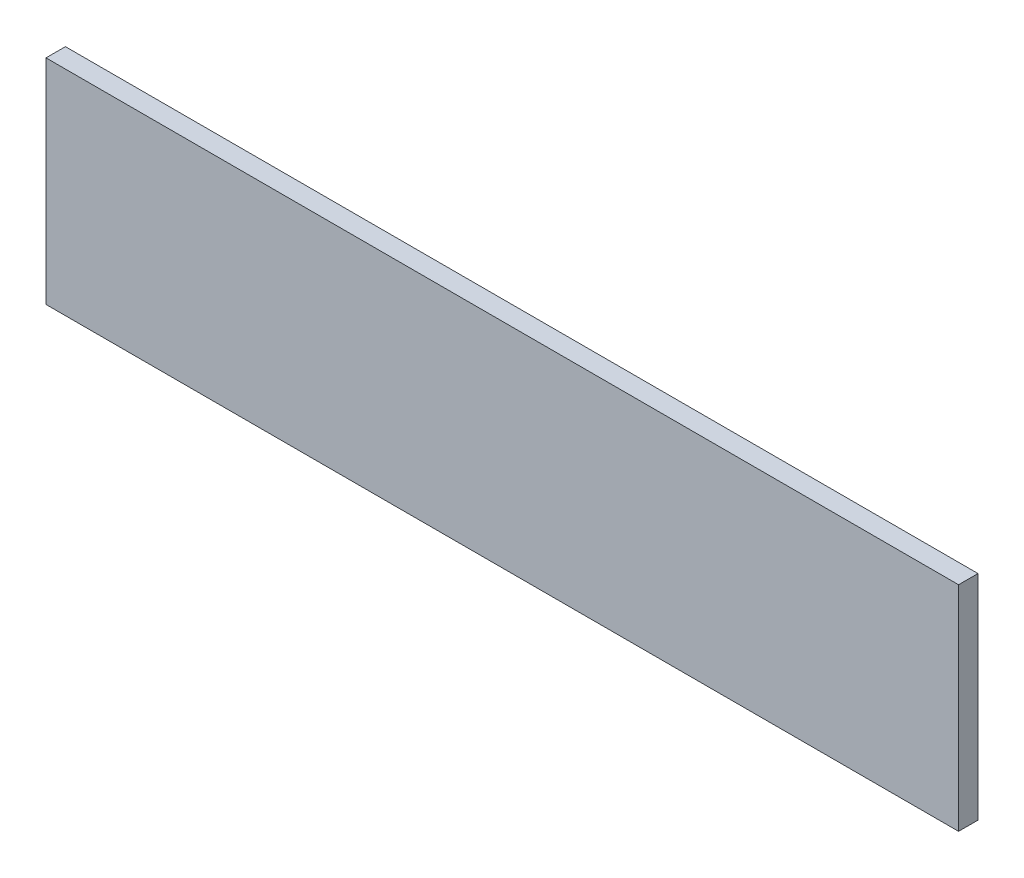
ISO-10303-21;
HEADER;
FILE_DESCRIPTION(('STEP AP214'),'2;1');
FILE_NAME('part.step','',(''),(''),'','','');
FILE_SCHEMA(('AUTOMOTIVE_DESIGN { 1 0 10303 214 1 1 1 1 }'));
ENDSEC;
DATA;
#1=APPLICATION_CONTEXT('core data for automotive mechanical design processes');
#2=APPLICATION_PROTOCOL_DEFINITION('international standard','automotive_design',2000,#1);
#3=PRODUCT_CONTEXT('',#1,'mechanical');
#4=PRODUCT('Part','Part','',(#3));
#5=PRODUCT_RELATED_PRODUCT_CATEGORY('part','',(#4));
#6=PRODUCT_DEFINITION_FORMATION('','',#4);
#7=PRODUCT_DEFINITION_CONTEXT('part definition',#1,'design');
#8=PRODUCT_DEFINITION('design','',#6,#7);
#9=PRODUCT_DEFINITION_SHAPE('','',#8);
#10=(LENGTH_UNIT() NAMED_UNIT(*) SI_UNIT(.MILLI.,.METRE.));
#11=(NAMED_UNIT(*) PLANE_ANGLE_UNIT() SI_UNIT($,.RADIAN.));
#12=(NAMED_UNIT(*) SI_UNIT($,.STERADIAN.) SOLID_ANGLE_UNIT());
#13=UNCERTAINTY_MEASURE_WITH_UNIT(LENGTH_MEASURE(1.E-05),#10,'distance_accuracy_value','');
#14=(GEOMETRIC_REPRESENTATION_CONTEXT(3) GLOBAL_UNCERTAINTY_ASSIGNED_CONTEXT((#13)) GLOBAL_UNIT_ASSIGNED_CONTEXT((#10,
#11,#12)) REPRESENTATION_CONTEXT('',''));
#15=CARTESIAN_POINT('',(0.,0.,0.));
#16=DIRECTION('',(0.,0.,1.));
#17=DIRECTION('',(1.,0.,0.));
#18=AXIS2_PLACEMENT_3D('',#15,#16,#17);
#19=CARTESIAN_POINT('',(470.,110.,10.));
#20=DIRECTION('',(-1.,0.,0.));
#21=DIRECTION('',(0.,0.,1.));
#22=AXIS2_PLACEMENT_3D('',#19,#20,#21);
#23=PLANE('',#22);
#24=DIRECTION('',(0.,1.,0.));
#25=VECTOR('',#24,1.);
#26=CARTESIAN_POINT('',(470.,110.,0.));
#27=LINE('',#26,#25);
#28=CARTESIAN_POINT('',(470.,0.,0.));
#29=VERTEX_POINT('',#28);
#30=CARTESIAN_POINT('',(470.,110.,0.));
#31=VERTEX_POINT('',#30);
#32=EDGE_CURVE('E96',#29,#31,#27,.T.);
#33=ORIENTED_EDGE('',*,*,#32,.T.);
#34=DIRECTION('',(0.,0.,-1.));
#35=VECTOR('',#34,1.);
#36=CARTESIAN_POINT('',(470.,110.,10.));
#37=LINE('',#36,#35);
#38=CARTESIAN_POINT('',(470.,110.,10.));
#39=VERTEX_POINT('',#38);
#40=EDGE_CURVE('E11',#39,#31,#37,.T.);
#41=ORIENTED_EDGE('',*,*,#40,.F.);
#42=DIRECTION('',(0.,1.,0.));
#43=VECTOR('',#42,1.);
#44=CARTESIAN_POINT('',(470.,110.,10.));
#45=LINE('',#44,#43);
#46=CARTESIAN_POINT('',(470.,0.,10.));
#47=VERTEX_POINT('',#46);
#48=EDGE_CURVE('E84',#47,#39,#45,.T.);
#49=ORIENTED_EDGE('',*,*,#48,.F.);
#50=DIRECTION('',(0.,0.,-1.));
#51=VECTOR('',#50,1.);
#52=CARTESIAN_POINT('',(470.,0.,10.));
#53=LINE('',#52,#51);
#54=EDGE_CURVE('E92',#47,#29,#53,.T.);
#55=ORIENTED_EDGE('',*,*,#54,.T.);
#56=EDGE_LOOP('',(#33,#41,#49,#55));
#57=FACE_BOUND('',#56,.T.);
#58=ADVANCED_FACE('F33',(#57),#23,.F.);
#59=CARTESIAN_POINT('',(470.,110.,10.));
#60=DIRECTION('',(0.,-1.,0.));
#61=DIRECTION('',(1.,0.,0.));
#62=AXIS2_PLACEMENT_3D('',#59,#60,#61);
#63=PLANE('',#62);
#64=DIRECTION('',(-1.,0.,0.));
#65=VECTOR('',#64,1.);
#66=CARTESIAN_POINT('',(470.,110.,0.));
#67=LINE('',#66,#65);
#68=CARTESIAN_POINT('',(0.,110.,0.));
#69=VERTEX_POINT('',#68);
#70=EDGE_CURVE('E88',#31,#69,#67,.T.);
#71=ORIENTED_EDGE('',*,*,#70,.T.);
#72=DIRECTION('',(0.,0.,-1.));
#73=VECTOR('',#72,1.);
#74=CARTESIAN_POINT('',(0.,110.,10.));
#75=LINE('',#74,#73);
#76=CARTESIAN_POINT('',(0.,110.,10.));
#77=VERTEX_POINT('',#76);
#78=EDGE_CURVE('E41',#77,#69,#75,.T.);
#79=ORIENTED_EDGE('',*,*,#78,.F.);
#80=DIRECTION('',(-1.,0.,0.));
#81=VECTOR('',#80,1.);
#82=CARTESIAN_POINT('',(470.,110.,10.));
#83=LINE('',#82,#81);
#84=EDGE_CURVE('E79',#39,#77,#83,.T.);
#85=ORIENTED_EDGE('',*,*,#84,.F.);
#86=ORIENTED_EDGE('',*,*,#40,.T.);
#87=EDGE_LOOP('',(#71,#79,#85,#86));
#88=FACE_BOUND('',#87,.T.);
#89=ADVANCED_FACE('F87',(#88),#63,.F.);
#90=CARTESIAN_POINT('',(0.,110.,10.));
#91=DIRECTION('',(1.,0.,0.));
#92=DIRECTION('',(0.,0.,-1.));
#93=AXIS2_PLACEMENT_3D('',#90,#91,#92);
#94=PLANE('',#93);
#95=DIRECTION('',(0.,-1.,0.));
#96=VECTOR('',#95,1.);
#97=CARTESIAN_POINT('',(0.,110.,0.));
#98=LINE('',#97,#96);
#99=CARTESIAN_POINT('',(0.,0.,0.));
#100=VERTEX_POINT('',#99);
#101=EDGE_CURVE('E66',#69,#100,#98,.T.);
#102=ORIENTED_EDGE('',*,*,#101,.T.);
#103=DIRECTION('',(0.,0.,-1.));
#104=VECTOR('',#103,1.);
#105=CARTESIAN_POINT('',(0.,0.,10.));
#106=LINE('',#105,#104);
#107=CARTESIAN_POINT('',(0.,0.,10.));
#108=VERTEX_POINT('',#107);
#109=EDGE_CURVE('E89',#108,#100,#106,.T.);
#110=ORIENTED_EDGE('',*,*,#109,.F.);
#111=DIRECTION('',(0.,-1.,0.));
#112=VECTOR('',#111,1.);
#113=CARTESIAN_POINT('',(0.,110.,10.));
#114=LINE('',#113,#112);
#115=EDGE_CURVE('E82',#77,#108,#114,.T.);
#116=ORIENTED_EDGE('',*,*,#115,.F.);
#117=ORIENTED_EDGE('',*,*,#78,.T.);
#118=EDGE_LOOP('',(#102,#110,#116,#117));
#119=FACE_BOUND('',#118,.T.);
#120=ADVANCED_FACE('F90',(#119),#94,.F.);
#121=CARTESIAN_POINT('',(470.,0.,10.));
#122=DIRECTION('',(0.,1.,0.));
#123=DIRECTION('',(-1.,0.,0.));
#124=AXIS2_PLACEMENT_3D('',#121,#122,#123);
#125=PLANE('',#124);
#126=DIRECTION('',(1.,0.,0.));
#127=VECTOR('',#126,1.);
#128=CARTESIAN_POINT('',(470.,0.,0.));
#129=LINE('',#128,#127);
#130=EDGE_CURVE('E72',#100,#29,#129,.T.);
#131=ORIENTED_EDGE('',*,*,#130,.T.);
#132=ORIENTED_EDGE('',*,*,#54,.F.);
#133=DIRECTION('',(1.,0.,0.));
#134=VECTOR('',#133,1.);
#135=CARTESIAN_POINT('',(470.,0.,10.));
#136=LINE('',#135,#134);
#137=EDGE_CURVE('E49',#108,#47,#136,.T.);
#138=ORIENTED_EDGE('',*,*,#137,.F.);
#139=ORIENTED_EDGE('',*,*,#109,.T.);
#140=EDGE_LOOP('',(#131,#132,#138,#139));
#141=FACE_BOUND('',#140,.T.);
#142=ADVANCED_FACE('F103',(#141),#125,.F.);
#143=CARTESIAN_POINT('',(0.,0.,10.));
#144=DIRECTION('',(0.,0.,-1.));
#145=DIRECTION('',(-1.,0.,0.));
#146=AXIS2_PLACEMENT_3D('',#143,#144,#145);
#147=PLANE('',#146);
#148=ORIENTED_EDGE('',*,*,#48,.T.);
#149=ORIENTED_EDGE('',*,*,#84,.T.);
#150=ORIENTED_EDGE('',*,*,#115,.T.);
#151=ORIENTED_EDGE('',*,*,#137,.T.);
#152=EDGE_LOOP('',(#148,#149,#150,#151));
#153=FACE_BOUND('',#152,.T.);
#154=ADVANCED_FACE('F80',(#153),#147,.F.);
#155=CARTESIAN_POINT('',(0.,0.,0.));
#156=DIRECTION('',(0.,0.,-1.));
#157=DIRECTION('',(-1.,0.,0.));
#158=AXIS2_PLACEMENT_3D('',#155,#156,#157);
#159=PLANE('',#158);
#160=ORIENTED_EDGE('',*,*,#32,.F.);
#161=ORIENTED_EDGE('',*,*,#130,.F.);
#162=ORIENTED_EDGE('',*,*,#101,.F.);
#163=ORIENTED_EDGE('',*,*,#70,.F.);
#164=EDGE_LOOP('',(#160,#161,#162,#163));
#165=FACE_BOUND('',#164,.T.);
#166=ADVANCED_FACE('F106',(#165),#159,.T.);
#167=CLOSED_SHELL('',(#58,#89,#120,#142,#154,#166));
#168=MANIFOLD_SOLID_BREP('B2',#167);
#169=ADVANCED_BREP_SHAPE_REPRESENTATION('',(#18,#168),#14);
#170=SHAPE_DEFINITION_REPRESENTATION(#9,#169);
ENDSEC;
END-ISO-10303-21;
